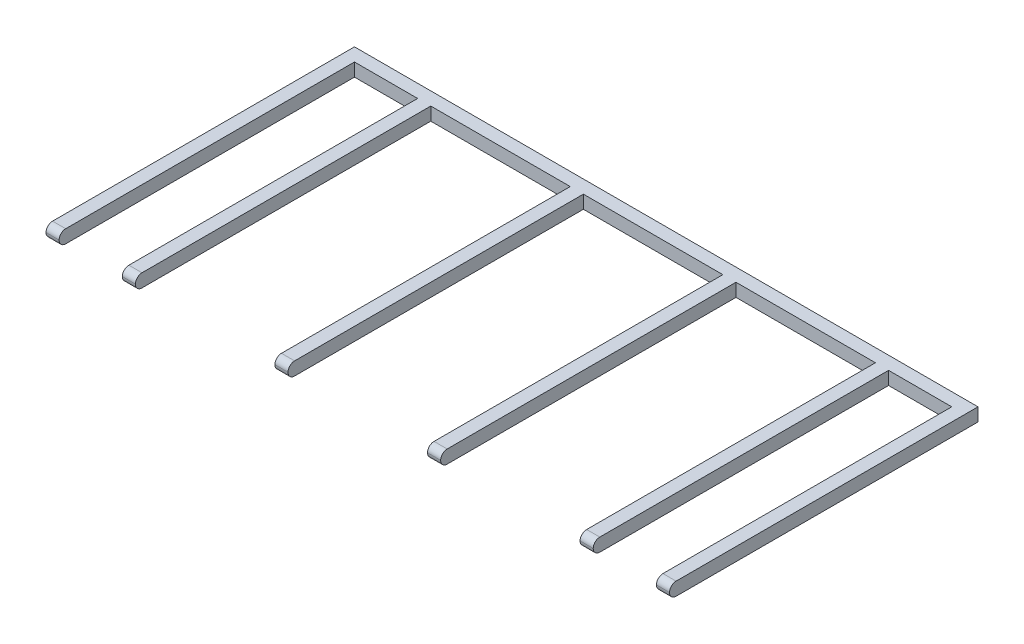
ISO-10303-21;
HEADER;
FILE_DESCRIPTION(('STEP AP214'),'2;1');
FILE_NAME('part.step','',(''),(''),'','','');
FILE_SCHEMA(('AUTOMOTIVE_DESIGN { 1 0 10303 214 1 1 1 1 }'));
ENDSEC;
DATA;
#1=APPLICATION_CONTEXT('core data for automotive mechanical design processes');
#2=APPLICATION_PROTOCOL_DEFINITION('international standard','automotive_design',2000,#1);
#3=PRODUCT_CONTEXT('',#1,'mechanical');
#4=PRODUCT('Part','Part','',(#3));
#5=PRODUCT_RELATED_PRODUCT_CATEGORY('part','',(#4));
#6=PRODUCT_DEFINITION_FORMATION('','',#4);
#7=PRODUCT_DEFINITION_CONTEXT('part definition',#1,'design');
#8=PRODUCT_DEFINITION('design','',#6,#7);
#9=PRODUCT_DEFINITION_SHAPE('','',#8);
#10=(LENGTH_UNIT() NAMED_UNIT(*) SI_UNIT(.MILLI.,.METRE.));
#11=(NAMED_UNIT(*) PLANE_ANGLE_UNIT() SI_UNIT($,.RADIAN.));
#12=(NAMED_UNIT(*) SI_UNIT($,.STERADIAN.) SOLID_ANGLE_UNIT());
#13=UNCERTAINTY_MEASURE_WITH_UNIT(LENGTH_MEASURE(1.E-05),#10,'distance_accuracy_value','');
#14=(GEOMETRIC_REPRESENTATION_CONTEXT(3) GLOBAL_UNCERTAINTY_ASSIGNED_CONTEXT((#13)) GLOBAL_UNIT_ASSIGNED_CONTEXT((#10,
#11,#12)) REPRESENTATION_CONTEXT('',''));
#15=CARTESIAN_POINT('',(0.,0.,0.));
#16=DIRECTION('',(0.,0.,1.));
#17=DIRECTION('',(1.,0.,0.));
#18=AXIS2_PLACEMENT_3D('',#15,#16,#17);
#19=CARTESIAN_POINT('',(241.3,-2.54,2.54));
#20=DIRECTION('',(0.,0.,-1.));
#21=DIRECTION('',(-1.,0.,0.));
#22=AXIS2_PLACEMENT_3D('',#19,#20,#21);
#23=PLANE('',#22);
#24=DIRECTION('',(0.,-1.,0.));
#25=VECTOR('',#24,1.);
#26=CARTESIAN_POINT('',(236.22,-2.54,2.54));
#27=LINE('',#26,#25);
#28=CARTESIAN_POINT('',(236.22,2.54,2.54000000000003));
#29=VERTEX_POINT('',#28);
#30=CARTESIAN_POINT('',(236.22,-2.54,2.54));
#31=VERTEX_POINT('',#30);
#32=EDGE_CURVE('E229',#29,#31,#27,.T.);
#33=ORIENTED_EDGE('',*,*,#32,.F.);
#34=DIRECTION('',(-1.,0.,0.));
#35=VECTOR('',#34,1.);
#36=CARTESIAN_POINT('',(241.3,2.54,2.54));
#37=LINE('',#36,#35);
#38=CARTESIAN_POINT('',(211.7725,2.54,2.54));
#39=VERTEX_POINT('',#38);
#40=EDGE_CURVE('E236',#29,#39,#37,.T.);
#41=ORIENTED_EDGE('',*,*,#40,.T.);
#42=DIRECTION('',(0.,1.,0.));
#43=VECTOR('',#42,1.);
#44=CARTESIAN_POINT('',(211.7725,-2.54,2.54));
#45=LINE('',#44,#43);
#46=CARTESIAN_POINT('',(211.7725,-2.54,2.54));
#47=VERTEX_POINT('',#46);
#48=EDGE_CURVE('E260',#47,#39,#45,.T.);
#49=ORIENTED_EDGE('',*,*,#48,.F.);
#50=DIRECTION('',(-1.,0.,0.));
#51=VECTOR('',#50,1.);
#52=CARTESIAN_POINT('',(241.3,-2.54,2.54));
#53=LINE('',#52,#51);
#54=EDGE_CURVE('E249',#31,#47,#53,.T.);
#55=ORIENTED_EDGE('',*,*,#54,.F.);
#56=EDGE_LOOP('',(#33,#41,#49,#55));
#57=FACE_BOUND('',#56,.T.);
#58=ADVANCED_FACE('F33',(#57),#23,.F.);
#59=DIRECTION('',(0.,-1.,0.));
#60=VECTOR('',#59,1.);
#61=CARTESIAN_POINT('',(206.6925,-2.54,2.54));
#62=LINE('',#61,#60);
#63=CARTESIAN_POINT('',(206.6925,2.54,2.54000000000003));
#64=VERTEX_POINT('',#63);
#65=CARTESIAN_POINT('',(206.6925,-2.54,2.54));
#66=VERTEX_POINT('',#65);
#67=EDGE_CURVE('E262',#64,#66,#62,.T.);
#68=ORIENTED_EDGE('',*,*,#67,.F.);
#69=CARTESIAN_POINT('',(152.7175,2.54,2.54));
#70=VERTEX_POINT('',#69);
#71=EDGE_CURVE('E244',#64,#70,#37,.T.);
#72=ORIENTED_EDGE('',*,*,#71,.T.);
#73=DIRECTION('',(0.,1.,0.));
#74=VECTOR('',#73,1.);
#75=CARTESIAN_POINT('',(152.7175,-2.54,2.54));
#76=LINE('',#75,#74);
#77=CARTESIAN_POINT('',(152.7175,-2.54,2.54));
#78=VERTEX_POINT('',#77);
#79=EDGE_CURVE('E273',#78,#70,#76,.T.);
#80=ORIENTED_EDGE('',*,*,#79,.F.);
#81=EDGE_CURVE('E339',#66,#78,#53,.T.);
#82=ORIENTED_EDGE('',*,*,#81,.F.);
#83=EDGE_LOOP('',(#68,#72,#80,#82));
#84=FACE_BOUND('',#83,.T.);
#85=ADVANCED_FACE('F487',(#84),#23,.F.);
#86=DIRECTION('',(0.,-1.,0.));
#87=VECTOR('',#86,1.);
#88=CARTESIAN_POINT('',(147.6375,-2.54,2.54));
#89=LINE('',#88,#87);
#90=CARTESIAN_POINT('',(147.6375,2.54,2.54000000000003));
#91=VERTEX_POINT('',#90);
#92=CARTESIAN_POINT('',(147.6375,-2.54,2.54));
#93=VERTEX_POINT('',#92);
#94=EDGE_CURVE('E276',#91,#93,#89,.T.);
#95=ORIENTED_EDGE('',*,*,#94,.F.);
#96=CARTESIAN_POINT('',(93.6625000000001,2.54,2.54));
#97=VERTEX_POINT('',#96);
#98=EDGE_CURVE('E507',#91,#97,#37,.T.);
#99=ORIENTED_EDGE('',*,*,#98,.T.);
#100=DIRECTION('',(0.,1.,0.));
#101=VECTOR('',#100,1.);
#102=CARTESIAN_POINT('',(93.6625,-2.54,2.54));
#103=LINE('',#102,#101);
#104=CARTESIAN_POINT('',(93.6625000000001,-2.54,2.54));
#105=VERTEX_POINT('',#104);
#106=EDGE_CURVE('E287',#105,#97,#103,.T.);
#107=ORIENTED_EDGE('',*,*,#106,.F.);
#108=EDGE_CURVE('E470',#93,#105,#53,.T.);
#109=ORIENTED_EDGE('',*,*,#108,.F.);
#110=EDGE_LOOP('',(#95,#99,#107,#109));
#111=FACE_BOUND('',#110,.T.);
#112=ADVANCED_FACE('F506',(#111),#23,.F.);
#113=DIRECTION('',(0.,-1.,0.));
#114=VECTOR('',#113,1.);
#115=CARTESIAN_POINT('',(88.5825,-2.54,2.54));
#116=LINE('',#115,#114);
#117=CARTESIAN_POINT('',(88.5825,2.54,2.54000000000003));
#118=VERTEX_POINT('',#117);
#119=CARTESIAN_POINT('',(88.5825000000001,-2.54,2.54));
#120=VERTEX_POINT('',#119);
#121=EDGE_CURVE('E290',#118,#120,#116,.T.);
#122=ORIENTED_EDGE('',*,*,#121,.F.);
#123=CARTESIAN_POINT('',(34.6075,2.54,2.54));
#124=VERTEX_POINT('',#123);
#125=EDGE_CURVE('E527',#118,#124,#37,.T.);
#126=ORIENTED_EDGE('',*,*,#125,.T.);
#127=DIRECTION('',(0.,1.,0.));
#128=VECTOR('',#127,1.);
#129=CARTESIAN_POINT('',(34.6075,-2.54,2.54));
#130=LINE('',#129,#128);
#131=CARTESIAN_POINT('',(34.6075,-2.54,2.54));
#132=VERTEX_POINT('',#131);
#133=EDGE_CURVE('E301',#132,#124,#130,.T.);
#134=ORIENTED_EDGE('',*,*,#133,.F.);
#135=EDGE_CURVE('E468',#120,#132,#53,.T.);
#136=ORIENTED_EDGE('',*,*,#135,.F.);
#137=EDGE_LOOP('',(#122,#126,#134,#136));
#138=FACE_BOUND('',#137,.T.);
#139=ADVANCED_FACE('F530',(#138),#23,.F.);
#140=DIRECTION('',(0.,-1.,0.));
#141=VECTOR('',#140,1.);
#142=CARTESIAN_POINT('',(29.5275,-2.54,2.54));
#143=LINE('',#142,#141);
#144=CARTESIAN_POINT('',(29.5275,2.54,2.54000000000003));
#145=VERTEX_POINT('',#144);
#146=CARTESIAN_POINT('',(29.5275000000001,-2.54,2.54));
#147=VERTEX_POINT('',#146);
#148=EDGE_CURVE('E304',#145,#147,#143,.T.);
#149=ORIENTED_EDGE('',*,*,#148,.F.);
#150=CARTESIAN_POINT('',(5.08000000000006,2.54,2.54));
#151=VERTEX_POINT('',#150);
#152=EDGE_CURVE('E246',#145,#151,#37,.T.);
#153=ORIENTED_EDGE('',*,*,#152,.T.);
#154=DIRECTION('',(0.,1.,0.));
#155=VECTOR('',#154,1.);
#156=CARTESIAN_POINT('',(5.08,-2.54,2.54));
#157=LINE('',#156,#155);
#158=CARTESIAN_POINT('',(5.08000000000006,-2.54,2.54));
#159=VERTEX_POINT('',#158);
#160=EDGE_CURVE('E314',#159,#151,#157,.T.);
#161=ORIENTED_EDGE('',*,*,#160,.F.);
#162=EDGE_CURVE('E336',#147,#159,#53,.T.);
#163=ORIENTED_EDGE('',*,*,#162,.F.);
#164=EDGE_LOOP('',(#149,#153,#161,#163));
#165=FACE_BOUND('',#164,.T.);
#166=ADVANCED_FACE('F548',(#165),#23,.F.);
#167=CARTESIAN_POINT('',(241.3,-2.54,-2.54));
#168=DIRECTION('',(0.,1.,0.));
#169=DIRECTION('',(0.,0.,1.));
#170=AXIS2_PLACEMENT_3D('',#167,#168,#169);
#171=PLANE('',#170);
#172=DIRECTION('',(0.,0.,-1.));
#173=VECTOR('',#172,1.);
#174=CARTESIAN_POINT('',(241.3,-2.54,-2.54));
#175=LINE('',#174,#173);
#176=CARTESIAN_POINT('',(241.3,-2.54000000000002,114.3));
#177=VERTEX_POINT('',#176);
#178=CARTESIAN_POINT('',(241.3,-2.54,-2.54));
#179=VERTEX_POINT('',#178);
#180=EDGE_CURVE('E318',#177,#179,#175,.T.);
#181=ORIENTED_EDGE('',*,*,#180,.F.);
#182=DIRECTION('',(1.,0.,0.));
#183=VECTOR('',#182,1.);
#184=CARTESIAN_POINT('',(236.22,-2.54000000000002,114.3));
#185=LINE('',#184,#183);
#186=CARTESIAN_POINT('',(236.22,-2.54,114.3));
#187=VERTEX_POINT('',#186);
#188=EDGE_CURVE('E421',#177,#187,#185,.F.);
#189=ORIENTED_EDGE('',*,*,#188,.T.);
#190=DIRECTION('',(0.,0.,-1.));
#191=VECTOR('',#190,1.);
#192=CARTESIAN_POINT('',(236.22,-2.54,116.84));
#193=LINE('',#192,#191);
#194=EDGE_CURVE('E232',#187,#31,#193,.T.);
#195=ORIENTED_EDGE('',*,*,#194,.T.);
#196=ORIENTED_EDGE('',*,*,#54,.T.);
#197=DIRECTION('',(0.,0.,-1.));
#198=VECTOR('',#197,1.);
#199=CARTESIAN_POINT('',(211.7725,-2.54,116.84));
#200=LINE('',#199,#198);
#201=CARTESIAN_POINT('',(211.7725,-2.54,114.3));
#202=VERTEX_POINT('',#201);
#203=EDGE_CURVE('E256',#202,#47,#200,.T.);
#204=ORIENTED_EDGE('',*,*,#203,.F.);
#205=DIRECTION('',(1.,0.,0.));
#206=VECTOR('',#205,1.);
#207=CARTESIAN_POINT('',(206.6925,-2.54000000000002,114.3));
#208=LINE('',#207,#206);
#209=CARTESIAN_POINT('',(206.6925,-2.54,114.3));
#210=VERTEX_POINT('',#209);
#211=EDGE_CURVE('E406',#202,#210,#208,.F.);
#212=ORIENTED_EDGE('',*,*,#211,.T.);
#213=DIRECTION('',(0.,0.,-1.));
#214=VECTOR('',#213,1.);
#215=CARTESIAN_POINT('',(206.6925,-2.54,116.84));
#216=LINE('',#215,#214);
#217=EDGE_CURVE('E258',#210,#66,#216,.T.);
#218=ORIENTED_EDGE('',*,*,#217,.T.);
#219=ORIENTED_EDGE('',*,*,#81,.T.);
#220=DIRECTION('',(0.,0.,-1.));
#221=VECTOR('',#220,1.);
#222=CARTESIAN_POINT('',(152.7175,-2.54,116.84));
#223=LINE('',#222,#221);
#224=CARTESIAN_POINT('',(152.7175,-2.54,114.3));
#225=VERTEX_POINT('',#224);
#226=EDGE_CURVE('E269',#225,#78,#223,.T.);
#227=ORIENTED_EDGE('',*,*,#226,.F.);
#228=DIRECTION('',(1.,0.,0.));
#229=VECTOR('',#228,1.);
#230=CARTESIAN_POINT('',(147.6375,-2.54000000000002,114.3));
#231=LINE('',#230,#229);
#232=CARTESIAN_POINT('',(147.6375,-2.54,114.3));
#233=VERTEX_POINT('',#232);
#234=EDGE_CURVE('E390',#225,#233,#231,.F.);
#235=ORIENTED_EDGE('',*,*,#234,.T.);
#236=DIRECTION('',(0.,0.,-1.));
#237=VECTOR('',#236,1.);
#238=CARTESIAN_POINT('',(147.6375,-2.54,116.84));
#239=LINE('',#238,#237);
#240=EDGE_CURVE('E271',#233,#93,#239,.T.);
#241=ORIENTED_EDGE('',*,*,#240,.T.);
#242=ORIENTED_EDGE('',*,*,#108,.T.);
#243=DIRECTION('',(0.,0.,-1.));
#244=VECTOR('',#243,1.);
#245=CARTESIAN_POINT('',(93.6625,-2.54,116.84));
#246=LINE('',#245,#244);
#247=CARTESIAN_POINT('',(93.6625,-2.54,114.3));
#248=VERTEX_POINT('',#247);
#249=EDGE_CURVE('E283',#248,#105,#246,.T.);
#250=ORIENTED_EDGE('',*,*,#249,.F.);
#251=DIRECTION('',(1.,0.,0.));
#252=VECTOR('',#251,1.);
#253=CARTESIAN_POINT('',(88.5825,-2.54000000000002,114.3));
#254=LINE('',#253,#252);
#255=CARTESIAN_POINT('',(88.5825,-2.54,114.3));
#256=VERTEX_POINT('',#255);
#257=EDGE_CURVE('E374',#248,#256,#254,.F.);
#258=ORIENTED_EDGE('',*,*,#257,.T.);
#259=DIRECTION('',(0.,0.,-1.));
#260=VECTOR('',#259,1.);
#261=CARTESIAN_POINT('',(88.5825,-2.54,116.84));
#262=LINE('',#261,#260);
#263=EDGE_CURVE('E285',#256,#120,#262,.T.);
#264=ORIENTED_EDGE('',*,*,#263,.T.);
#265=ORIENTED_EDGE('',*,*,#135,.T.);
#266=DIRECTION('',(0.,0.,-1.));
#267=VECTOR('',#266,1.);
#268=CARTESIAN_POINT('',(34.6075,-2.54,116.84));
#269=LINE('',#268,#267);
#270=CARTESIAN_POINT('',(34.6075,-2.54,114.3));
#271=VERTEX_POINT('',#270);
#272=EDGE_CURVE('E297',#271,#132,#269,.T.);
#273=ORIENTED_EDGE('',*,*,#272,.F.);
#274=DIRECTION('',(1.,0.,0.));
#275=VECTOR('',#274,1.);
#276=CARTESIAN_POINT('',(29.5275,-2.54000000000002,114.3));
#277=LINE('',#276,#275);
#278=CARTESIAN_POINT('',(29.5275,-2.54,114.3));
#279=VERTEX_POINT('',#278);
#280=EDGE_CURVE('E358',#271,#279,#277,.F.);
#281=ORIENTED_EDGE('',*,*,#280,.T.);
#282=DIRECTION('',(0.,0.,-1.));
#283=VECTOR('',#282,1.);
#284=CARTESIAN_POINT('',(29.5275,-2.54,116.84));
#285=LINE('',#284,#283);
#286=EDGE_CURVE('E299',#279,#147,#285,.T.);
#287=ORIENTED_EDGE('',*,*,#286,.T.);
#288=ORIENTED_EDGE('',*,*,#162,.T.);
#289=DIRECTION('',(0.,0.,-1.));
#290=VECTOR('',#289,1.);
#291=CARTESIAN_POINT('',(5.08,-2.54,116.84));
#292=LINE('',#291,#290);
#293=CARTESIAN_POINT('',(5.08,-2.54,114.3));
#294=VERTEX_POINT('',#293);
#295=EDGE_CURVE('E311',#294,#159,#292,.T.);
#296=ORIENTED_EDGE('',*,*,#295,.F.);
#297=DIRECTION('',(1.,0.,0.));
#298=VECTOR('',#297,1.);
#299=CARTESIAN_POINT('',(0.,-2.54000000000002,114.3));
#300=LINE('',#299,#298);
#301=CARTESIAN_POINT('',(0.,-2.54000000000002,114.3));
#302=VERTEX_POINT('',#301);
#303=EDGE_CURVE('E343',#294,#302,#300,.F.);
#304=ORIENTED_EDGE('',*,*,#303,.T.);
#305=DIRECTION('',(0.,0.,-1.));
#306=VECTOR('',#305,1.);
#307=CARTESIAN_POINT('',(0.,-2.54,-2.54));
#308=LINE('',#307,#306);
#309=CARTESIAN_POINT('',(0.,-2.54,-2.54));
#310=VERTEX_POINT('',#309);
#311=EDGE_CURVE('E317',#302,#310,#308,.T.);
#312=ORIENTED_EDGE('',*,*,#311,.T.);
#313=DIRECTION('',(-1.,0.,0.));
#314=VECTOR('',#313,1.);
#315=CARTESIAN_POINT('',(241.3,-2.54,-2.54));
#316=LINE('',#315,#314);
#317=EDGE_CURVE('E333',#179,#310,#316,.T.);
#318=ORIENTED_EDGE('',*,*,#317,.F.);
#319=EDGE_LOOP('',(#181,#189,#195,#196,#204,#212,#218,#219,#227,#235,#241,#242,#250,#258,#264,
#265,#273,#281,#287,#288,#296,#304,#312,#318));
#320=FACE_BOUND('',#319,.T.);
#321=ADVANCED_FACE('F428',(#320),#171,.F.);
#322=CARTESIAN_POINT('',(241.3,-2.54,-2.54));
#323=DIRECTION('',(0.,0.,1.));
#324=DIRECTION('',(0.,-1.,0.));
#325=AXIS2_PLACEMENT_3D('',#322,#323,#324);
#326=PLANE('',#325);
#327=DIRECTION('',(0.,1.,0.));
#328=VECTOR('',#327,1.);
#329=CARTESIAN_POINT('',(0.,-2.54,-2.54));
#330=LINE('',#329,#328);
#331=CARTESIAN_POINT('',(0.,2.54,-2.54));
#332=VERTEX_POINT('',#331);
#333=EDGE_CURVE('E327',#310,#332,#330,.T.);
#334=ORIENTED_EDGE('',*,*,#333,.T.);
#335=DIRECTION('',(-1.,0.,0.));
#336=VECTOR('',#335,1.);
#337=CARTESIAN_POINT('',(241.3,2.54,-2.54));
#338=LINE('',#337,#336);
#339=CARTESIAN_POINT('',(241.3,2.54,-2.54));
#340=VERTEX_POINT('',#339);
#341=EDGE_CURVE('E243',#340,#332,#338,.T.);
#342=ORIENTED_EDGE('',*,*,#341,.F.);
#343=DIRECTION('',(0.,1.,0.));
#344=VECTOR('',#343,1.);
#345=CARTESIAN_POINT('',(241.3,-2.54,-2.54));
#346=LINE('',#345,#344);
#347=EDGE_CURVE('E320',#179,#340,#346,.T.);
#348=ORIENTED_EDGE('',*,*,#347,.F.);
#349=ORIENTED_EDGE('',*,*,#317,.T.);
#350=EDGE_LOOP('',(#334,#342,#348,#349));
#351=FACE_BOUND('',#350,.T.);
#352=ADVANCED_FACE('F443',(#351),#326,.F.);
#353=CARTESIAN_POINT('',(241.3,2.54,-2.54));
#354=DIRECTION('',(0.,-1.,0.));
#355=DIRECTION('',(0.,0.,-1.));
#356=AXIS2_PLACEMENT_3D('',#353,#354,#355);
#357=PLANE('',#356);
#358=DIRECTION('',(0.,0.,-1.));
#359=VECTOR('',#358,1.);
#360=CARTESIAN_POINT('',(236.22,2.54,116.84));
#361=LINE('',#360,#359);
#362=CARTESIAN_POINT('',(236.22,2.54,114.3));
#363=VERTEX_POINT('',#362);
#364=EDGE_CURVE('E225',#363,#29,#361,.T.);
#365=ORIENTED_EDGE('',*,*,#364,.F.);
#366=DIRECTION('',(-1.,0.,0.));
#367=VECTOR('',#366,1.);
#368=CARTESIAN_POINT('',(241.3,2.53999999999999,114.3));
#369=LINE('',#368,#367);
#370=CARTESIAN_POINT('',(241.3,2.53999999999999,114.3));
#371=VERTEX_POINT('',#370);
#372=EDGE_CURVE('E11',#363,#371,#369,.F.);
#373=ORIENTED_EDGE('',*,*,#372,.T.);
#374=DIRECTION('',(0.,0.,1.));
#375=VECTOR('',#374,1.);
#376=CARTESIAN_POINT('',(241.3,2.54,-2.54));
#377=LINE('',#376,#375);
#378=EDGE_CURVE('E323',#340,#371,#377,.T.);
#379=ORIENTED_EDGE('',*,*,#378,.F.);
#380=ORIENTED_EDGE('',*,*,#341,.T.);
#381=DIRECTION('',(0.,0.,1.));
#382=VECTOR('',#381,1.);
#383=CARTESIAN_POINT('',(0.,2.54,-2.54));
#384=LINE('',#383,#382);
#385=CARTESIAN_POINT('',(0.,2.53999999999999,114.3));
#386=VERTEX_POINT('',#385);
#387=EDGE_CURVE('E321',#332,#386,#384,.T.);
#388=ORIENTED_EDGE('',*,*,#387,.T.);
#389=DIRECTION('',(-1.,0.,0.));
#390=VECTOR('',#389,1.);
#391=CARTESIAN_POINT('',(5.08,2.53999999999999,114.3));
#392=LINE('',#391,#390);
#393=CARTESIAN_POINT('',(5.08,2.54,114.3));
#394=VERTEX_POINT('',#393);
#395=EDGE_CURVE('E350',#386,#394,#392,.F.);
#396=ORIENTED_EDGE('',*,*,#395,.T.);
#397=DIRECTION('',(0.,0.,-1.));
#398=VECTOR('',#397,1.);
#399=CARTESIAN_POINT('',(5.08,2.54,116.84));
#400=LINE('',#399,#398);
#401=EDGE_CURVE('E308',#394,#151,#400,.T.);
#402=ORIENTED_EDGE('',*,*,#401,.T.);
#403=ORIENTED_EDGE('',*,*,#152,.F.);
#404=DIRECTION('',(0.,0.,-1.));
#405=VECTOR('',#404,1.);
#406=CARTESIAN_POINT('',(29.5275,2.54,116.84));
#407=LINE('',#406,#405);
#408=CARTESIAN_POINT('',(29.5275,2.54,114.3));
#409=VERTEX_POINT('',#408);
#410=EDGE_CURVE('E293',#409,#145,#407,.T.);
#411=ORIENTED_EDGE('',*,*,#410,.F.);
#412=DIRECTION('',(-1.,0.,0.));
#413=VECTOR('',#412,1.);
#414=CARTESIAN_POINT('',(34.6075,2.53999999999999,114.3));
#415=LINE('',#414,#413);
#416=CARTESIAN_POINT('',(34.6075,2.54,114.3));
#417=VERTEX_POINT('',#416);
#418=EDGE_CURVE('E365',#409,#417,#415,.F.);
#419=ORIENTED_EDGE('',*,*,#418,.T.);
#420=DIRECTION('',(0.,0.,-1.));
#421=VECTOR('',#420,1.);
#422=CARTESIAN_POINT('',(34.6075,2.54,116.84));
#423=LINE('',#422,#421);
#424=EDGE_CURVE('E295',#417,#124,#423,.T.);
#425=ORIENTED_EDGE('',*,*,#424,.T.);
#426=ORIENTED_EDGE('',*,*,#125,.F.);
#427=DIRECTION('',(0.,0.,-1.));
#428=VECTOR('',#427,1.);
#429=CARTESIAN_POINT('',(88.5825,2.54,116.84));
#430=LINE('',#429,#428);
#431=CARTESIAN_POINT('',(88.5825,2.54,114.3));
#432=VERTEX_POINT('',#431);
#433=EDGE_CURVE('E279',#432,#118,#430,.T.);
#434=ORIENTED_EDGE('',*,*,#433,.F.);
#435=DIRECTION('',(-1.,0.,0.));
#436=VECTOR('',#435,1.);
#437=CARTESIAN_POINT('',(93.6625,2.53999999999999,114.3));
#438=LINE('',#437,#436);
#439=CARTESIAN_POINT('',(93.6625,2.54,114.3));
#440=VERTEX_POINT('',#439);
#441=EDGE_CURVE('E381',#432,#440,#438,.F.);
#442=ORIENTED_EDGE('',*,*,#441,.T.);
#443=DIRECTION('',(0.,0.,-1.));
#444=VECTOR('',#443,1.);
#445=CARTESIAN_POINT('',(93.6625,2.54,116.84));
#446=LINE('',#445,#444);
#447=EDGE_CURVE('E281',#440,#97,#446,.T.);
#448=ORIENTED_EDGE('',*,*,#447,.T.);
#449=ORIENTED_EDGE('',*,*,#98,.F.);
#450=DIRECTION('',(0.,0.,-1.));
#451=VECTOR('',#450,1.);
#452=CARTESIAN_POINT('',(147.6375,2.54,116.84));
#453=LINE('',#452,#451);
#454=CARTESIAN_POINT('',(147.6375,2.54,114.3));
#455=VERTEX_POINT('',#454);
#456=EDGE_CURVE('E265',#455,#91,#453,.T.);
#457=ORIENTED_EDGE('',*,*,#456,.F.);
#458=DIRECTION('',(-1.,0.,0.));
#459=VECTOR('',#458,1.);
#460=CARTESIAN_POINT('',(152.7175,2.53999999999999,114.3));
#461=LINE('',#460,#459);
#462=CARTESIAN_POINT('',(152.7175,2.54,114.3));
#463=VERTEX_POINT('',#462);
#464=EDGE_CURVE('E397',#455,#463,#461,.F.);
#465=ORIENTED_EDGE('',*,*,#464,.T.);
#466=DIRECTION('',(0.,0.,-1.));
#467=VECTOR('',#466,1.);
#468=CARTESIAN_POINT('',(152.7175,2.54,116.84));
#469=LINE('',#468,#467);
#470=EDGE_CURVE('E267',#463,#70,#469,.T.);
#471=ORIENTED_EDGE('',*,*,#470,.T.);
#472=ORIENTED_EDGE('',*,*,#71,.F.);
#473=DIRECTION('',(0.,0.,-1.));
#474=VECTOR('',#473,1.);
#475=CARTESIAN_POINT('',(206.6925,2.54,116.84));
#476=LINE('',#475,#474);
#477=CARTESIAN_POINT('',(206.6925,2.54,114.3));
#478=VERTEX_POINT('',#477);
#479=EDGE_CURVE('E250',#478,#64,#476,.T.);
#480=ORIENTED_EDGE('',*,*,#479,.F.);
#481=DIRECTION('',(-1.,0.,0.));
#482=VECTOR('',#481,1.);
#483=CARTESIAN_POINT('',(211.7725,2.53999999999999,114.3));
#484=LINE('',#483,#482);
#485=CARTESIAN_POINT('',(211.7725,2.54,114.3));
#486=VERTEX_POINT('',#485);
#487=EDGE_CURVE('E413',#478,#486,#484,.F.);
#488=ORIENTED_EDGE('',*,*,#487,.T.);
#489=DIRECTION('',(0.,0.,-1.));
#490=VECTOR('',#489,1.);
#491=CARTESIAN_POINT('',(211.7725,2.54,116.84));
#492=LINE('',#491,#490);
#493=EDGE_CURVE('E239',#486,#39,#492,.T.);
#494=ORIENTED_EDGE('',*,*,#493,.T.);
#495=ORIENTED_EDGE('',*,*,#40,.F.);
#496=EDGE_LOOP('',(#365,#373,#379,#380,#388,#396,#402,#403,#411,#419,#425,#426,#434,#442,#448,
#449,#457,#465,#471,#472,#480,#488,#494,#495));
#497=FACE_BOUND('',#496,.T.);
#498=ADVANCED_FACE('F237',(#497),#357,.F.);
#499=CARTESIAN_POINT('',(241.3,0.,0.));
#500=DIRECTION('',(1.,0.,0.));
#501=DIRECTION('',(0.,0.,-1.));
#502=AXIS2_PLACEMENT_3D('',#499,#500,#501);
#503=PLANE('',#502);
#504=CARTESIAN_POINT('',(241.3,0.,114.3));
#505=DIRECTION('',(1.,0.,0.));
#506=DIRECTION('',(0.,0.,-1.));
#507=AXIS2_PLACEMENT_3D('',#504,#505,#506);
#508=CIRCLE('',#507,2.54);
#509=CARTESIAN_POINT('',(241.3,0.,116.84));
#510=VERTEX_POINT('',#509);
#511=EDGE_CURVE('E415',#371,#510,#508,.T.);
#512=ORIENTED_EDGE('',*,*,#511,.T.);
#513=CARTESIAN_POINT('',(241.3,0.,114.3));
#514=DIRECTION('',(1.,0.,0.));
#515=DIRECTION('',(0.,0.,-1.));
#516=AXIS2_PLACEMENT_3D('',#513,#514,#515);
#517=CIRCLE('',#516,2.54);
#518=EDGE_CURVE('E419',#510,#177,#517,.T.);
#519=ORIENTED_EDGE('',*,*,#518,.T.);
#520=ORIENTED_EDGE('',*,*,#180,.T.);
#521=ORIENTED_EDGE('',*,*,#347,.T.);
#522=ORIENTED_EDGE('',*,*,#378,.T.);
#523=EDGE_LOOP('',(#512,#519,#520,#521,#522));
#524=FACE_BOUND('',#523,.T.);
#525=ADVANCED_FACE('F439',(#524),#503,.T.);
#526=CARTESIAN_POINT('',(0.,0.,0.));
#527=DIRECTION('',(1.,0.,0.));
#528=DIRECTION('',(0.,0.,-1.));
#529=AXIS2_PLACEMENT_3D('',#526,#527,#528);
#530=PLANE('',#529);
#531=ORIENTED_EDGE('',*,*,#311,.F.);
#532=CARTESIAN_POINT('',(0.,0.,114.3));
#533=DIRECTION('',(1.,0.,0.));
#534=DIRECTION('',(0.,0.,-1.));
#535=AXIS2_PLACEMENT_3D('',#532,#533,#534);
#536=CIRCLE('',#535,2.54);
#537=CARTESIAN_POINT('',(0.,0.,116.84));
#538=VERTEX_POINT('',#537);
#539=EDGE_CURVE('E348',#302,#538,#536,.F.);
#540=ORIENTED_EDGE('',*,*,#539,.T.);
#541=CARTESIAN_POINT('',(0.,0.,114.3));
#542=DIRECTION('',(1.,0.,0.));
#543=DIRECTION('',(0.,0.,-1.));
#544=AXIS2_PLACEMENT_3D('',#541,#542,#543);
#545=CIRCLE('',#544,2.54);
#546=EDGE_CURVE('E346',#538,#386,#545,.F.);
#547=ORIENTED_EDGE('',*,*,#546,.T.);
#548=ORIENTED_EDGE('',*,*,#387,.F.);
#549=ORIENTED_EDGE('',*,*,#333,.F.);
#550=EDGE_LOOP('',(#531,#540,#547,#548,#549));
#551=FACE_BOUND('',#550,.T.);
#552=ADVANCED_FACE('F449',(#551),#530,.F.);
#553=CARTESIAN_POINT('',(5.08,2.54,116.84));
#554=DIRECTION('',(-1.,0.,0.));
#555=DIRECTION('',(0.,0.,1.));
#556=AXIS2_PLACEMENT_3D('',#553,#554,#555);
#557=PLANE('',#556);
#558=CARTESIAN_POINT('',(5.08,0.,114.3));
#559=DIRECTION('',(-1.,0.,0.));
#560=DIRECTION('',(0.,0.,1.));
#561=AXIS2_PLACEMENT_3D('',#558,#559,#560);
#562=CIRCLE('',#561,2.54);
#563=CARTESIAN_POINT('',(5.08,0.,116.84));
#564=VERTEX_POINT('',#563);
#565=EDGE_CURVE('E338',#394,#564,#562,.F.);
#566=ORIENTED_EDGE('',*,*,#565,.T.);
#567=CARTESIAN_POINT('',(5.08,0.,114.3));
#568=DIRECTION('',(-1.,0.,0.));
#569=DIRECTION('',(0.,0.,1.));
#570=AXIS2_PLACEMENT_3D('',#567,#568,#569);
#571=CIRCLE('',#570,2.54);
#572=EDGE_CURVE('E341',#564,#294,#571,.F.);
#573=ORIENTED_EDGE('',*,*,#572,.T.);
#574=ORIENTED_EDGE('',*,*,#295,.T.);
#575=ORIENTED_EDGE('',*,*,#160,.T.);
#576=ORIENTED_EDGE('',*,*,#401,.F.);
#577=EDGE_LOOP('',(#566,#573,#574,#575,#576));
#578=FACE_BOUND('',#577,.T.);
#579=ADVANCED_FACE('F461',(#578),#557,.F.);
#580=CARTESIAN_POINT('',(0.,0.,114.3));
#581=DIRECTION('',(1.,0.,0.));
#582=DIRECTION('',(0.,0.,-1.));
#583=AXIS2_PLACEMENT_3D('',#580,#581,#582);
#584=CYLINDRICAL_SURFACE('',#583,2.54);
#585=ORIENTED_EDGE('',*,*,#395,.F.);
#586=ORIENTED_EDGE('',*,*,#546,.F.);
#587=DIRECTION('',(-1.,0.,0.));
#588=VECTOR('',#587,1.);
#589=CARTESIAN_POINT('',(0.,0.,116.84));
#590=LINE('',#589,#588);
#591=EDGE_CURVE('E307',#564,#538,#590,.T.);
#592=ORIENTED_EDGE('',*,*,#591,.F.);
#593=ORIENTED_EDGE('',*,*,#565,.F.);
#594=EDGE_LOOP('',(#585,#586,#592,#593));
#595=FACE_BOUND('',#594,.T.);
#596=ADVANCED_FACE('F453',(#595),#584,.T.);
#597=CARTESIAN_POINT('',(0.,0.,114.3));
#598=DIRECTION('',(-1.,0.,0.));
#599=DIRECTION('',(0.,0.,1.));
#600=AXIS2_PLACEMENT_3D('',#597,#598,#599);
#601=CYLINDRICAL_SURFACE('',#600,2.54);
#602=ORIENTED_EDGE('',*,*,#539,.F.);
#603=ORIENTED_EDGE('',*,*,#303,.F.);
#604=ORIENTED_EDGE('',*,*,#572,.F.);
#605=ORIENTED_EDGE('',*,*,#591,.T.);
#606=EDGE_LOOP('',(#602,#603,#604,#605));
#607=FACE_BOUND('',#606,.T.);
#608=ADVANCED_FACE('F457',(#607),#601,.T.);
#609=CARTESIAN_POINT('',(29.5275,2.54,116.84));
#610=DIRECTION('',(1.,0.,0.));
#611=DIRECTION('',(0.,0.,-1.));
#612=AXIS2_PLACEMENT_3D('',#609,#610,#611);
#613=PLANE('',#612);
#614=ORIENTED_EDGE('',*,*,#286,.F.);
#615=CARTESIAN_POINT('',(29.5275,0.,114.3));
#616=DIRECTION('',(1.,0.,0.));
#617=DIRECTION('',(0.,0.,-1.));
#618=AXIS2_PLACEMENT_3D('',#615,#616,#617);
#619=CIRCLE('',#618,2.54);
#620=CARTESIAN_POINT('',(29.5275,0.,116.84));
#621=VERTEX_POINT('',#620);
#622=EDGE_CURVE('E363',#279,#621,#619,.F.);
#623=ORIENTED_EDGE('',*,*,#622,.T.);
#624=CARTESIAN_POINT('',(29.5275,0.,114.3));
#625=DIRECTION('',(1.,0.,0.));
#626=DIRECTION('',(0.,0.,-1.));
#627=AXIS2_PLACEMENT_3D('',#624,#625,#626);
#628=CIRCLE('',#627,2.54);
#629=EDGE_CURVE('E361',#621,#409,#628,.F.);
#630=ORIENTED_EDGE('',*,*,#629,.T.);
#631=ORIENTED_EDGE('',*,*,#410,.T.);
#632=ORIENTED_EDGE('',*,*,#148,.T.);
#633=EDGE_LOOP('',(#614,#623,#630,#631,#632));
#634=FACE_BOUND('',#633,.T.);
#635=ADVANCED_FACE('F542',(#634),#613,.F.);
#636=CARTESIAN_POINT('',(34.6075,2.54,116.84));
#637=DIRECTION('',(-1.,0.,0.));
#638=DIRECTION('',(0.,0.,1.));
#639=AXIS2_PLACEMENT_3D('',#636,#637,#638);
#640=PLANE('',#639);
#641=CARTESIAN_POINT('',(34.6075,0.,114.3));
#642=DIRECTION('',(-1.,0.,0.));
#643=DIRECTION('',(0.,0.,1.));
#644=AXIS2_PLACEMENT_3D('',#641,#642,#643);
#645=CIRCLE('',#644,2.54);
#646=CARTESIAN_POINT('',(34.6075,0.,116.84));
#647=VERTEX_POINT('',#646);
#648=EDGE_CURVE('E352',#417,#647,#645,.F.);
#649=ORIENTED_EDGE('',*,*,#648,.T.);
#650=CARTESIAN_POINT('',(34.6075,0.,114.3));
#651=DIRECTION('',(-1.,0.,0.));
#652=DIRECTION('',(0.,0.,1.));
#653=AXIS2_PLACEMENT_3D('',#650,#651,#652);
#654=CIRCLE('',#653,2.54);
#655=EDGE_CURVE('E356',#647,#271,#654,.F.);
#656=ORIENTED_EDGE('',*,*,#655,.T.);
#657=ORIENTED_EDGE('',*,*,#272,.T.);
#658=ORIENTED_EDGE('',*,*,#133,.T.);
#659=ORIENTED_EDGE('',*,*,#424,.F.);
#660=EDGE_LOOP('',(#649,#656,#657,#658,#659));
#661=FACE_BOUND('',#660,.T.);
#662=ADVANCED_FACE('F533',(#661),#640,.F.);
#663=CARTESIAN_POINT('',(88.5825,2.54,116.84));
#664=DIRECTION('',(1.,0.,0.));
#665=DIRECTION('',(0.,0.,-1.));
#666=AXIS2_PLACEMENT_3D('',#663,#664,#665);
#667=PLANE('',#666);
#668=ORIENTED_EDGE('',*,*,#263,.F.);
#669=CARTESIAN_POINT('',(88.5825,0.,114.3));
#670=DIRECTION('',(1.,0.,0.));
#671=DIRECTION('',(0.,0.,-1.));
#672=AXIS2_PLACEMENT_3D('',#669,#670,#671);
#673=CIRCLE('',#672,2.54);
#674=CARTESIAN_POINT('',(88.5825,0.,116.84));
#675=VERTEX_POINT('',#674);
#676=EDGE_CURVE('E379',#256,#675,#673,.F.);
#677=ORIENTED_EDGE('',*,*,#676,.T.);
#678=CARTESIAN_POINT('',(88.5825,0.,114.3));
#679=DIRECTION('',(1.,0.,0.));
#680=DIRECTION('',(0.,0.,-1.));
#681=AXIS2_PLACEMENT_3D('',#678,#679,#680);
#682=CIRCLE('',#681,2.54);
#683=EDGE_CURVE('E377',#675,#432,#682,.F.);
#684=ORIENTED_EDGE('',*,*,#683,.T.);
#685=ORIENTED_EDGE('',*,*,#433,.T.);
#686=ORIENTED_EDGE('',*,*,#121,.T.);
#687=EDGE_LOOP('',(#668,#677,#684,#685,#686));
#688=FACE_BOUND('',#687,.T.);
#689=ADVANCED_FACE('F520',(#688),#667,.F.);
#690=CARTESIAN_POINT('',(93.6625,2.54,116.84));
#691=DIRECTION('',(-1.,0.,0.));
#692=DIRECTION('',(0.,0.,1.));
#693=AXIS2_PLACEMENT_3D('',#690,#691,#692);
#694=PLANE('',#693);
#695=CARTESIAN_POINT('',(93.6625,0.,114.3));
#696=DIRECTION('',(-1.,0.,0.));
#697=DIRECTION('',(0.,0.,1.));
#698=AXIS2_PLACEMENT_3D('',#695,#696,#697);
#699=CIRCLE('',#698,2.54);
#700=CARTESIAN_POINT('',(93.6625,0.,116.84));
#701=VERTEX_POINT('',#700);
#702=EDGE_CURVE('E367',#440,#701,#699,.F.);
#703=ORIENTED_EDGE('',*,*,#702,.T.);
#704=CARTESIAN_POINT('',(93.6625,0.,114.3));
#705=DIRECTION('',(-1.,0.,0.));
#706=DIRECTION('',(0.,0.,1.));
#707=AXIS2_PLACEMENT_3D('',#704,#705,#706);
#708=CIRCLE('',#707,2.54);
#709=EDGE_CURVE('E372',#701,#248,#708,.F.);
#710=ORIENTED_EDGE('',*,*,#709,.T.);
#711=ORIENTED_EDGE('',*,*,#249,.T.);
#712=ORIENTED_EDGE('',*,*,#106,.T.);
#713=ORIENTED_EDGE('',*,*,#447,.F.);
#714=EDGE_LOOP('',(#703,#710,#711,#712,#713));
#715=FACE_BOUND('',#714,.T.);
#716=ADVANCED_FACE('F510',(#715),#694,.F.);
#717=CARTESIAN_POINT('',(147.6375,2.54,116.84));
#718=DIRECTION('',(1.,0.,0.));
#719=DIRECTION('',(0.,0.,-1.));
#720=AXIS2_PLACEMENT_3D('',#717,#718,#719);
#721=PLANE('',#720);
#722=ORIENTED_EDGE('',*,*,#240,.F.);
#723=CARTESIAN_POINT('',(147.6375,0.,114.3));
#724=DIRECTION('',(1.,0.,0.));
#725=DIRECTION('',(0.,0.,-1.));
#726=AXIS2_PLACEMENT_3D('',#723,#724,#725);
#727=CIRCLE('',#726,2.54);
#728=CARTESIAN_POINT('',(147.6375,0.,116.84));
#729=VERTEX_POINT('',#728);
#730=EDGE_CURVE('E395',#233,#729,#727,.F.);
#731=ORIENTED_EDGE('',*,*,#730,.T.);
#732=CARTESIAN_POINT('',(147.6375,0.,114.3));
#733=DIRECTION('',(1.,0.,0.));
#734=DIRECTION('',(0.,0.,-1.));
#735=AXIS2_PLACEMENT_3D('',#732,#733,#734);
#736=CIRCLE('',#735,2.54);
#737=EDGE_CURVE('E393',#729,#455,#736,.F.);
#738=ORIENTED_EDGE('',*,*,#737,.T.);
#739=ORIENTED_EDGE('',*,*,#456,.T.);
#740=ORIENTED_EDGE('',*,*,#94,.T.);
#741=EDGE_LOOP('',(#722,#731,#738,#739,#740));
#742=FACE_BOUND('',#741,.T.);
#743=ADVANCED_FACE('F499',(#742),#721,.F.);
#744=CARTESIAN_POINT('',(152.7175,2.54,116.84));
#745=DIRECTION('',(-1.,0.,0.));
#746=DIRECTION('',(0.,0.,1.));
#747=AXIS2_PLACEMENT_3D('',#744,#745,#746);
#748=PLANE('',#747);
#749=CARTESIAN_POINT('',(152.7175,0.,114.3));
#750=DIRECTION('',(-1.,0.,0.));
#751=DIRECTION('',(0.,0.,1.));
#752=AXIS2_PLACEMENT_3D('',#749,#750,#751);
#753=CIRCLE('',#752,2.54);
#754=CARTESIAN_POINT('',(152.7175,0.,116.84));
#755=VERTEX_POINT('',#754);
#756=EDGE_CURVE('E383',#463,#755,#753,.F.);
#757=ORIENTED_EDGE('',*,*,#756,.T.);
#758=CARTESIAN_POINT('',(152.7175,0.,114.3));
#759=DIRECTION('',(-1.,0.,0.));
#760=DIRECTION('',(0.,0.,1.));
#761=AXIS2_PLACEMENT_3D('',#758,#759,#760);
#762=CIRCLE('',#761,2.54);
#763=EDGE_CURVE('E388',#755,#225,#762,.F.);
#764=ORIENTED_EDGE('',*,*,#763,.T.);
#765=ORIENTED_EDGE('',*,*,#226,.T.);
#766=ORIENTED_EDGE('',*,*,#79,.T.);
#767=ORIENTED_EDGE('',*,*,#470,.F.);
#768=EDGE_LOOP('',(#757,#764,#765,#766,#767));
#769=FACE_BOUND('',#768,.T.);
#770=ADVANCED_FACE('F491',(#769),#748,.F.);
#771=CARTESIAN_POINT('',(206.6925,2.54,116.84));
#772=DIRECTION('',(1.,0.,0.));
#773=DIRECTION('',(0.,0.,-1.));
#774=AXIS2_PLACEMENT_3D('',#771,#772,#773);
#775=PLANE('',#774);
#776=ORIENTED_EDGE('',*,*,#217,.F.);
#777=CARTESIAN_POINT('',(206.6925,0.,114.3));
#778=DIRECTION('',(1.,0.,0.));
#779=DIRECTION('',(0.,0.,-1.));
#780=AXIS2_PLACEMENT_3D('',#777,#778,#779);
#781=CIRCLE('',#780,2.54);
#782=CARTESIAN_POINT('',(206.6925,0.,116.84));
#783=VERTEX_POINT('',#782);
#784=EDGE_CURVE('E411',#210,#783,#781,.F.);
#785=ORIENTED_EDGE('',*,*,#784,.T.);
#786=CARTESIAN_POINT('',(206.6925,0.,114.3));
#787=DIRECTION('',(1.,0.,0.));
#788=DIRECTION('',(0.,0.,-1.));
#789=AXIS2_PLACEMENT_3D('',#786,#787,#788);
#790=CIRCLE('',#789,2.54);
#791=EDGE_CURVE('E409',#783,#478,#790,.F.);
#792=ORIENTED_EDGE('',*,*,#791,.T.);
#793=ORIENTED_EDGE('',*,*,#479,.T.);
#794=ORIENTED_EDGE('',*,*,#67,.T.);
#795=EDGE_LOOP('',(#776,#785,#792,#793,#794));
#796=FACE_BOUND('',#795,.T.);
#797=ADVANCED_FACE('F653',(#796),#775,.F.);
#798=CARTESIAN_POINT('',(211.7725,2.54,116.84));
#799=DIRECTION('',(-1.,0.,0.));
#800=DIRECTION('',(0.,0.,1.));
#801=AXIS2_PLACEMENT_3D('',#798,#799,#800);
#802=PLANE('',#801);
#803=CARTESIAN_POINT('',(211.7725,0.,114.3));
#804=DIRECTION('',(-1.,0.,0.));
#805=DIRECTION('',(0.,0.,1.));
#806=AXIS2_PLACEMENT_3D('',#803,#804,#805);
#807=CIRCLE('',#806,2.54);
#808=CARTESIAN_POINT('',(211.7725,0.,116.84));
#809=VERTEX_POINT('',#808);
#810=EDGE_CURVE('E399',#486,#809,#807,.F.);
#811=ORIENTED_EDGE('',*,*,#810,.T.);
#812=CARTESIAN_POINT('',(211.7725,0.,114.3));
#813=DIRECTION('',(-1.,0.,0.));
#814=DIRECTION('',(0.,0.,1.));
#815=AXIS2_PLACEMENT_3D('',#812,#813,#814);
#816=CIRCLE('',#815,2.54);
#817=EDGE_CURVE('E404',#809,#202,#816,.F.);
#818=ORIENTED_EDGE('',*,*,#817,.T.);
#819=ORIENTED_EDGE('',*,*,#203,.T.);
#820=ORIENTED_EDGE('',*,*,#48,.T.);
#821=ORIENTED_EDGE('',*,*,#493,.F.);
#822=EDGE_LOOP('',(#811,#818,#819,#820,#821));
#823=FACE_BOUND('',#822,.T.);
#824=ADVANCED_FACE('F662',(#823),#802,.F.);
#825=CARTESIAN_POINT('',(236.22,2.54,116.84));
#826=DIRECTION('',(1.,0.,0.));
#827=DIRECTION('',(0.,0.,-1.));
#828=AXIS2_PLACEMENT_3D('',#825,#826,#827);
#829=PLANE('',#828);
#830=ORIENTED_EDGE('',*,*,#194,.F.);
#831=CARTESIAN_POINT('',(236.22,0.,114.3));
#832=DIRECTION('',(1.,0.,0.));
#833=DIRECTION('',(0.,0.,-1.));
#834=AXIS2_PLACEMENT_3D('',#831,#832,#833);
#835=CIRCLE('',#834,2.54);
#836=CARTESIAN_POINT('',(236.22,0.,116.84));
#837=VERTEX_POINT('',#836);
#838=EDGE_CURVE('E42',#187,#837,#835,.F.);
#839=ORIENTED_EDGE('',*,*,#838,.T.);
#840=CARTESIAN_POINT('',(236.22,0.,114.3));
#841=DIRECTION('',(1.,0.,0.));
#842=DIRECTION('',(0.,0.,-1.));
#843=AXIS2_PLACEMENT_3D('',#840,#841,#842);
#844=CIRCLE('',#843,2.54);
#845=EDGE_CURVE('E52',#837,#363,#844,.F.);
#846=ORIENTED_EDGE('',*,*,#845,.T.);
#847=ORIENTED_EDGE('',*,*,#364,.T.);
#848=ORIENTED_EDGE('',*,*,#32,.T.);
#849=EDGE_LOOP('',(#830,#839,#846,#847,#848));
#850=FACE_BOUND('',#849,.T.);
#851=ADVANCED_FACE('F227',(#850),#829,.F.);
#852=CARTESIAN_POINT('',(29.5275,0.,114.3));
#853=DIRECTION('',(1.,0.,0.));
#854=DIRECTION('',(0.,0.,-1.));
#855=AXIS2_PLACEMENT_3D('',#852,#853,#854);
#856=CYLINDRICAL_SURFACE('',#855,2.54);
#857=ORIENTED_EDGE('',*,*,#418,.F.);
#858=ORIENTED_EDGE('',*,*,#629,.F.);
#859=DIRECTION('',(-1.,0.,0.));
#860=VECTOR('',#859,1.);
#861=CARTESIAN_POINT('',(29.5275,0.,116.84));
#862=LINE('',#861,#860);
#863=EDGE_CURVE('E233',#647,#621,#862,.T.);
#864=ORIENTED_EDGE('',*,*,#863,.F.);
#865=ORIENTED_EDGE('',*,*,#648,.F.);
#866=EDGE_LOOP('',(#857,#858,#864,#865));
#867=FACE_BOUND('',#866,.T.);
#868=ADVANCED_FACE('F546',(#867),#856,.T.);
#869=CARTESIAN_POINT('',(29.5275,0.,114.3));
#870=DIRECTION('',(-1.,0.,0.));
#871=DIRECTION('',(0.,0.,1.));
#872=AXIS2_PLACEMENT_3D('',#869,#870,#871);
#873=CYLINDRICAL_SURFACE('',#872,2.54);
#874=ORIENTED_EDGE('',*,*,#622,.F.);
#875=ORIENTED_EDGE('',*,*,#280,.F.);
#876=ORIENTED_EDGE('',*,*,#655,.F.);
#877=ORIENTED_EDGE('',*,*,#863,.T.);
#878=EDGE_LOOP('',(#874,#875,#876,#877));
#879=FACE_BOUND('',#878,.T.);
#880=ADVANCED_FACE('F538',(#879),#873,.T.);
#881=CARTESIAN_POINT('',(88.5825,0.,114.3));
#882=DIRECTION('',(1.,0.,0.));
#883=DIRECTION('',(0.,0.,-1.));
#884=AXIS2_PLACEMENT_3D('',#881,#882,#883);
#885=CYLINDRICAL_SURFACE('',#884,2.54);
#886=ORIENTED_EDGE('',*,*,#441,.F.);
#887=ORIENTED_EDGE('',*,*,#683,.F.);
#888=DIRECTION('',(-1.,0.,0.));
#889=VECTOR('',#888,1.);
#890=CARTESIAN_POINT('',(88.5825,0.,116.84));
#891=LINE('',#890,#889);
#892=EDGE_CURVE('E370',#701,#675,#891,.T.);
#893=ORIENTED_EDGE('',*,*,#892,.F.);
#894=ORIENTED_EDGE('',*,*,#702,.F.);
#895=EDGE_LOOP('',(#886,#887,#893,#894));
#896=FACE_BOUND('',#895,.T.);
#897=ADVANCED_FACE('F524',(#896),#885,.T.);
#898=CARTESIAN_POINT('',(88.5825,0.,114.3));
#899=DIRECTION('',(-1.,0.,0.));
#900=DIRECTION('',(0.,0.,1.));
#901=AXIS2_PLACEMENT_3D('',#898,#899,#900);
#902=CYLINDRICAL_SURFACE('',#901,2.54);
#903=ORIENTED_EDGE('',*,*,#676,.F.);
#904=ORIENTED_EDGE('',*,*,#257,.F.);
#905=ORIENTED_EDGE('',*,*,#709,.F.);
#906=ORIENTED_EDGE('',*,*,#892,.T.);
#907=EDGE_LOOP('',(#903,#904,#905,#906));
#908=FACE_BOUND('',#907,.T.);
#909=ADVANCED_FACE('F516',(#908),#902,.T.);
#910=CARTESIAN_POINT('',(147.6375,0.,114.3));
#911=DIRECTION('',(1.,0.,0.));
#912=DIRECTION('',(0.,0.,-1.));
#913=AXIS2_PLACEMENT_3D('',#910,#911,#912);
#914=CYLINDRICAL_SURFACE('',#913,2.54);
#915=ORIENTED_EDGE('',*,*,#464,.F.);
#916=ORIENTED_EDGE('',*,*,#737,.F.);
#917=DIRECTION('',(-1.,0.,0.));
#918=VECTOR('',#917,1.);
#919=CARTESIAN_POINT('',(147.6375,0.,116.84));
#920=LINE('',#919,#918);
#921=EDGE_CURVE('E386',#755,#729,#920,.T.);
#922=ORIENTED_EDGE('',*,*,#921,.F.);
#923=ORIENTED_EDGE('',*,*,#756,.F.);
#924=EDGE_LOOP('',(#915,#916,#922,#923));
#925=FACE_BOUND('',#924,.T.);
#926=ADVANCED_FACE('F713',(#925),#914,.T.);
#927=CARTESIAN_POINT('',(147.6375,0.,114.3));
#928=DIRECTION('',(-1.,0.,0.));
#929=DIRECTION('',(0.,0.,1.));
#930=AXIS2_PLACEMENT_3D('',#927,#928,#929);
#931=CYLINDRICAL_SURFACE('',#930,2.54);
#932=ORIENTED_EDGE('',*,*,#730,.F.);
#933=ORIENTED_EDGE('',*,*,#234,.F.);
#934=ORIENTED_EDGE('',*,*,#763,.F.);
#935=ORIENTED_EDGE('',*,*,#921,.T.);
#936=EDGE_LOOP('',(#932,#933,#934,#935));
#937=FACE_BOUND('',#936,.T.);
#938=ADVANCED_FACE('F496',(#937),#931,.T.);
#939=CARTESIAN_POINT('',(206.6925,0.,114.3));
#940=DIRECTION('',(1.,0.,0.));
#941=DIRECTION('',(0.,0.,-1.));
#942=AXIS2_PLACEMENT_3D('',#939,#940,#941);
#943=CYLINDRICAL_SURFACE('',#942,2.54);
#944=ORIENTED_EDGE('',*,*,#487,.F.);
#945=ORIENTED_EDGE('',*,*,#791,.F.);
#946=DIRECTION('',(-1.,0.,0.));
#947=VECTOR('',#946,1.);
#948=CARTESIAN_POINT('',(206.6925,0.,116.84));
#949=LINE('',#948,#947);
#950=EDGE_CURVE('E402',#809,#783,#949,.T.);
#951=ORIENTED_EDGE('',*,*,#950,.F.);
#952=ORIENTED_EDGE('',*,*,#810,.F.);
#953=EDGE_LOOP('',(#944,#945,#951,#952));
#954=FACE_BOUND('',#953,.T.);
#955=ADVANCED_FACE('F731',(#954),#943,.T.);
#956=CARTESIAN_POINT('',(206.6925,0.,114.3));
#957=DIRECTION('',(-1.,0.,0.));
#958=DIRECTION('',(0.,0.,1.));
#959=AXIS2_PLACEMENT_3D('',#956,#957,#958);
#960=CYLINDRICAL_SURFACE('',#959,2.54);
#961=ORIENTED_EDGE('',*,*,#784,.F.);
#962=ORIENTED_EDGE('',*,*,#211,.F.);
#963=ORIENTED_EDGE('',*,*,#817,.F.);
#964=ORIENTED_EDGE('',*,*,#950,.T.);
#965=EDGE_LOOP('',(#961,#962,#963,#964));
#966=FACE_BOUND('',#965,.T.);
#967=ADVANCED_FACE('F740',(#966),#960,.T.);
#968=CARTESIAN_POINT('',(236.22,0.,114.3));
#969=DIRECTION('',(1.,0.,0.));
#970=DIRECTION('',(0.,0.,-1.));
#971=AXIS2_PLACEMENT_3D('',#968,#969,#970);
#972=CYLINDRICAL_SURFACE('',#971,2.54);
#973=ORIENTED_EDGE('',*,*,#372,.F.);
#974=ORIENTED_EDGE('',*,*,#845,.F.);
#975=DIRECTION('',(-1.,0.,0.));
#976=VECTOR('',#975,1.);
#977=CARTESIAN_POINT('',(236.22,0.,116.84));
#978=LINE('',#977,#976);
#979=EDGE_CURVE('E37',#510,#837,#978,.T.);
#980=ORIENTED_EDGE('',*,*,#979,.F.);
#981=ORIENTED_EDGE('',*,*,#511,.F.);
#982=EDGE_LOOP('',(#973,#974,#980,#981));
#983=FACE_BOUND('',#982,.T.);
#984=ADVANCED_FACE('F35',(#983),#972,.T.);
#985=CARTESIAN_POINT('',(236.22,0.,114.3));
#986=DIRECTION('',(-1.,0.,0.));
#987=DIRECTION('',(0.,0.,1.));
#988=AXIS2_PLACEMENT_3D('',#985,#986,#987);
#989=CYLINDRICAL_SURFACE('',#988,2.54);
#990=ORIENTED_EDGE('',*,*,#838,.F.);
#991=ORIENTED_EDGE('',*,*,#188,.F.);
#992=ORIENTED_EDGE('',*,*,#518,.F.);
#993=ORIENTED_EDGE('',*,*,#979,.T.);
#994=EDGE_LOOP('',(#990,#991,#992,#993));
#995=FACE_BOUND('',#994,.T.);
#996=ADVANCED_FACE('F432',(#995),#989,.T.);
#997=CLOSED_SHELL('',(#58,#85,#112,#139,#166,#321,#352,#498,#525,#552,#579,#596,#608,#635,#662,
#689,#716,#743,#770,#797,#824,#851,#868,#880,#897,#909,#926,#938,#955,#967,#984,#996));
#998=MANIFOLD_SOLID_BREP('B2',#997);
#999=ADVANCED_BREP_SHAPE_REPRESENTATION('',(#18,#998),#14);
#1000=SHAPE_DEFINITION_REPRESENTATION(#9,#999);
ENDSEC;
END-ISO-10303-21;
